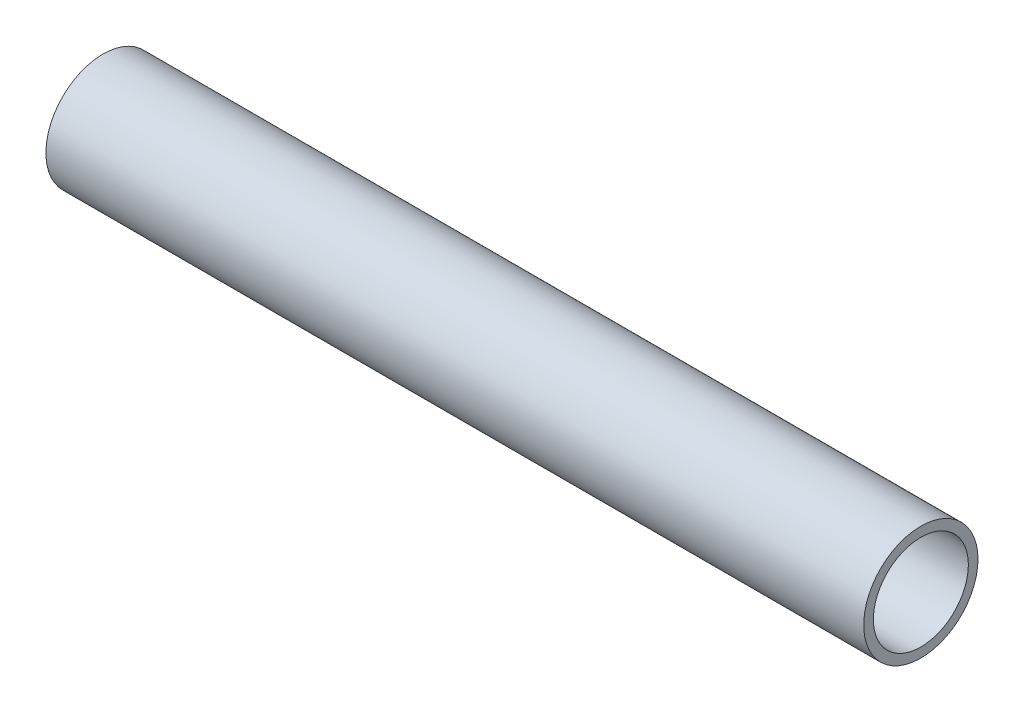
ISO-10303-21;
HEADER;
FILE_DESCRIPTION(('STEP AP214'),'2;1');
FILE_NAME('part.step','',(''),(''),'','','');
FILE_SCHEMA(('AUTOMOTIVE_DESIGN { 1 0 10303 214 1 1 1 1 }'));
ENDSEC;
DATA;
#1=APPLICATION_CONTEXT('core data for automotive mechanical design processes');
#2=APPLICATION_PROTOCOL_DEFINITION('international standard','automotive_design',2000,#1);
#3=PRODUCT_CONTEXT('',#1,'mechanical');
#4=PRODUCT('Part','Part','',(#3));
#5=PRODUCT_RELATED_PRODUCT_CATEGORY('part','',(#4));
#6=PRODUCT_DEFINITION_FORMATION('','',#4);
#7=PRODUCT_DEFINITION_CONTEXT('part definition',#1,'design');
#8=PRODUCT_DEFINITION('design','',#6,#7);
#9=PRODUCT_DEFINITION_SHAPE('','',#8);
#10=(LENGTH_UNIT() NAMED_UNIT(*) SI_UNIT(.MILLI.,.METRE.));
#11=(NAMED_UNIT(*) PLANE_ANGLE_UNIT() SI_UNIT($,.RADIAN.));
#12=(NAMED_UNIT(*) SI_UNIT($,.STERADIAN.) SOLID_ANGLE_UNIT());
#13=UNCERTAINTY_MEASURE_WITH_UNIT(LENGTH_MEASURE(1.E-05),#10,'distance_accuracy_value','');
#14=(GEOMETRIC_REPRESENTATION_CONTEXT(3) GLOBAL_UNCERTAINTY_ASSIGNED_CONTEXT((#13)) GLOBAL_UNIT_ASSIGNED_CONTEXT((#10,
#11,#12)) REPRESENTATION_CONTEXT('',''));
#15=CARTESIAN_POINT('',(0.,0.,0.));
#16=DIRECTION('',(0.,0.,1.));
#17=DIRECTION('',(1.,0.,0.));
#18=AXIS2_PLACEMENT_3D('',#15,#16,#17);
#19=CARTESIAN_POINT('',(-174.625,0.,0.));
#20=DIRECTION('',(1.,0.,0.));
#21=DIRECTION('',(0.,0.,-1.));
#22=AXIS2_PLACEMENT_3D('',#19,#20,#21);
#23=CYLINDRICAL_SURFACE('',#22,21.082);
#24=CARTESIAN_POINT('',(-95.25,0.,-21.082));
#25=CARTESIAN_POINT('',(-95.2500073037573,-0.177265588906064,-21.0819971511082));
#26=CARTESIAN_POINT('',(-95.2648956722781,-0.354633825443564,-21.0797407978607));
#27=CARTESIAN_POINT('',(-95.3240403602155,-0.704412011201185,-21.0709569196678));
#28=CARTESIAN_POINT('',(-95.3683252199961,-0.876816971803983,-21.064425243998));
#29=CARTESIAN_POINT('',(-95.4849091388346,-1.21155604974819,-21.0478246855302));
#30=CARTESIAN_POINT('',(-95.5571869641717,-1.37389769247853,-21.0377584843423));
#31=CARTESIAN_POINT('',(-95.7276530975323,-1.68412370373539,-21.0152009969064));
#32=CARTESIAN_POINT('',(-95.8258378289602,-1.83201006403648,-21.0027100454717));
#33=CARTESIAN_POINT('',(-96.0461542058056,-2.1103164343508,-20.9765819826565));
#34=CARTESIAN_POINT('',(-96.1684495601003,-2.24060616148058,-20.9629374218632));
#35=CARTESIAN_POINT('',(-96.4331633864275,-2.47889671955908,-20.9360982303561));
#36=CARTESIAN_POINT('',(-96.5755830188655,-2.58689626432783,-20.9229036256421));
#37=CARTESIAN_POINT('',(-96.8773786544134,-2.77804840978028,-20.8983859912104));
#38=CARTESIAN_POINT('',(-97.0368354067939,-2.86107486347092,-20.8870725883659));
#39=CARTESIAN_POINT('',(-97.3676295731584,-2.99911783525677,-20.8677000439257));
#40=CARTESIAN_POINT('',(-97.5389663337644,-3.05413589237424,-20.8596407235276));
#41=CARTESIAN_POINT('',(-97.8872863628436,-3.13419550245968,-20.8477621012251));
#42=CARTESIAN_POINT('',(-98.0642172558634,-3.15946016290709,-20.8439112577396));
#43=CARTESIAN_POINT('',(-98.419845943067,-3.17998699422211,-20.8407898425614));
#44=CARTESIAN_POINT('',(-98.5985436343971,-3.17525090142445,-20.8415190057945));
#45=CARTESIAN_POINT('',(-98.9510567099515,-3.13609297404926,-20.8474463775802));
#46=CARTESIAN_POINT('',(-99.1249004248299,-3.101919701057,-20.852607165254));
#47=CARTESIAN_POINT('',(-99.4643579756068,-3.00524659900985,-20.8667578327125));
#48=CARTESIAN_POINT('',(-99.6299715768266,-2.94274596272441,-20.8757478216156));
#49=CARTESIAN_POINT('',(-99.9490235812398,-2.7909340011809,-20.8965852461813));
#50=CARTESIAN_POINT('',(-100.102411162019,-2.70151746318004,-20.9084438587404));
#51=CARTESIAN_POINT('',(-100.392099144084,-2.498486828096,-20.9336742925736));
#52=CARTESIAN_POINT('',(-100.528398414064,-2.38487113028628,-20.9470462139227));
#53=CARTESIAN_POINT('',(-100.781481243325,-2.1353032656861,-20.9739618878806));
#54=CARTESIAN_POINT('',(-100.898054144489,-1.9991374095518,-20.9875060134767));
#55=CARTESIAN_POINT('',(-101.106725455512,-1.70906259522473,-21.0131148002247));
#56=CARTESIAN_POINT('',(-101.198823756631,-1.55515355820368,-21.0251794548033));
#57=CARTESIAN_POINT('',(-101.355942659601,-1.23377816277264,-21.0464826923882));
#58=CARTESIAN_POINT('',(-101.420946926471,-1.06630369822491,-21.0557195696406));
#59=CARTESIAN_POINT('',(-101.521848958346,-0.722645240857131,-21.070312259879));
#60=CARTESIAN_POINT('',(-101.557748707077,-0.546461842495156,-21.0756683373726));
#61=CARTESIAN_POINT('',(-101.599142333219,-0.192204765370484,-21.0818608911754));
#62=CARTESIAN_POINT('',(-101.604925808796,-0.0141656498471117,-21.0827404122035));
#63=CARTESIAN_POINT('',(-101.586691518388,0.340339952440575,-21.0799979514801));
#64=CARTESIAN_POINT('',(-101.562674682621,0.516806488119838,-21.0763761102388));
#65=CARTESIAN_POINT('',(-101.485762333879,0.862279899383912,-21.0650645063623));
#66=CARTESIAN_POINT('',(-101.433007989693,1.03131891039134,-21.0573946347692));
#67=CARTESIAN_POINT('',(-101.300267051749,1.35815274399449,-21.0388441665934));
#68=CARTESIAN_POINT('',(-101.220279170212,1.51594703443953,-21.0279634181826));
#69=CARTESIAN_POINT('',(-101.034662860785,1.8170851157619,-21.0040933283749));
#70=CARTESIAN_POINT('',(-100.928850826916,1.9603145348408,-20.9910891189132));
#71=CARTESIAN_POINT('',(-100.694845351182,2.22708618632573,-20.9644655933992));
#72=CARTESIAN_POINT('',(-100.566650597521,2.35062726403486,-20.9508462413297));
#73=CARTESIAN_POINT('',(-100.290229093112,2.57556977848285,-20.9243908347895));
#74=CARTESIAN_POINT('',(-100.141843493739,2.67677703259561,-20.9115622997957));
#75=CARTESIAN_POINT('',(-99.8300080053974,2.85282903090451,-20.888274456038));
#76=CARTESIAN_POINT('',(-99.6665585261644,2.92767449187153,-20.8778150828597));
#77=CARTESIAN_POINT('',(-99.3298127983176,3.04857772519442,-20.8605043047131));
#78=CARTESIAN_POINT('',(-99.156553855138,3.09473749350593,-20.8536401303661));
#79=CARTESIAN_POINT('',(-98.8046316089195,3.15728352894343,-20.8442630448294));
#80=CARTESIAN_POINT('',(-98.6259686832474,3.17367187018762,-20.8417498305174));
#81=CARTESIAN_POINT('',(-98.2702456638402,3.17616021106898,-20.8413705974415));
#82=CARTESIAN_POINT('',(-98.0931876803551,3.16256554437416,-20.8434577306442));
#83=CARTESIAN_POINT('',(-97.7439067922048,3.10612829026899,-20.8519421795031));
#84=CARTESIAN_POINT('',(-97.5716838795403,3.0632857512491,-20.8583394880282));
#85=CARTESIAN_POINT('',(-97.2370476835853,2.94967717748468,-20.874707044174));
#86=CARTESIAN_POINT('',(-97.0746269537971,2.87893265513937,-20.8846745386426));
#87=CARTESIAN_POINT('',(-96.7639105714977,2.71155871536682,-20.9070627102117));
#88=CARTESIAN_POINT('',(-96.6156154052644,2.61492840724794,-20.9194834717215));
#89=CARTESIAN_POINT('',(-96.3358087193127,2.39741725845485,-20.9455292166376));
#90=CARTESIAN_POINT('',(-96.2044739082908,2.27631033164997,-20.9591647100844));
#91=CARTESIAN_POINT('',(-95.9638828183518,2.01376149306829,-20.9860159394496));
#92=CARTESIAN_POINT('',(-95.8546316769312,1.87231486257537,-20.9992315770924));
#93=CARTESIAN_POINT('',(-95.6607669697578,1.57217776718591,-21.0238378848768));
#94=CARTESIAN_POINT('',(-95.5762935254673,1.41339594518084,-21.0352180180234));
#95=CARTESIAN_POINT('',(-95.4353412780308,1.08380087043067,-21.0547677779054));
#96=CARTESIAN_POINT('',(-95.3788335193363,0.913000272113382,-21.0629407235248));
#97=CARTESIAN_POINT('',(-95.3082168635909,0.61786433248082,-21.0732924950954));
#98=CARTESIAN_POINT('',(-95.2864189599853,0.495349503289427,-21.0765410154751));
#99=CARTESIAN_POINT('',(-95.2573080583054,0.248573261637359,-21.0808957533839));
#100=CARTESIAN_POINT('',(-95.2499948780599,0.124311871162614,-21.0820019978558));
#101=CARTESIAN_POINT('',(-95.25,0.,-21.082));
#102=B_SPLINE_CURVE_WITH_KNOTS('',3,(#24,#25,#26,#27,#28,#29,#30,#31,#32,#33,#34,#35,#36,#37,
#38,#39,#40,#41,#42,#43,#44,#45,#46,#47,#48,#49,#50,#51,#52,#53,#54,#55,#56,#57,#58,#59,#60,#61,
#62,#63,#64,#65,#66,#67,#68,#69,#70,#71,#72,#73,#74,#75,#76,#77,#78,#79,#80,#81,#82,#83,#84,#85,
#86,#87,#88,#89,#90,#91,#92,#93,#94,#95,#96,#97,#98,#99,#100,#101),.UNSPECIFIED.,.T.,.F.,(4,2,2,
2,2,2,2,2,2,2,2,2,2,2,2,2,2,2,2,2,2,2,2,2,2,2,2,2,2,2,2,2,2,2,2,2,2,2,4),(0.,0.531342512429038,
1.06320164882558,1.5946581376531,2.12604129424767,2.66116512439551,3.19631982343617,
3.73413403476704,4.27191869076775,4.80564452954641,5.33933947849273,5.86857170164552,
6.39781900700991,6.92916258470441,7.46054132064733,7.99727852314497,8.53401811031673,
9.07108083107699,9.6081069432693,10.1399593459211,10.6717951472021,11.2010416383702,
11.730313159249,12.2634633412738,12.7966447804,13.3342937698578,13.8719281396386,
14.4076397711918,14.9433140793118,15.4735585288678,16.0038021011393,16.5336376528597,
17.0634914377811,17.5984835709691,18.1336000206727,18.6716867332597,19.2092151415009,
19.5818368843675,19.9544539408189),.UNSPECIFIED.);
#103=CARTESIAN_POINT('',(-95.25,0.,-21.082));
#104=VERTEX_POINT('',#103);
#105=EDGE_CURVE('E77',#104,#104,#102,.T.);
#106=ORIENTED_EDGE('',*,*,#105,.F.);
#107=EDGE_LOOP('',(#106));
#108=FACE_BOUND('',#107,.T.);
#109=CARTESIAN_POINT('',(-146.05,0.,-21.082));
#110=CARTESIAN_POINT('',(-146.050007303757,-0.177265588906064,-21.0819971511082));
#111=CARTESIAN_POINT('',(-146.064895672278,-0.354633825443566,-21.0797407978607));
#112=CARTESIAN_POINT('',(-146.124040360215,-0.704412011201187,-21.0709569196678));
#113=CARTESIAN_POINT('',(-146.168325219996,-0.876816971803985,-21.064425243998));
#114=CARTESIAN_POINT('',(-146.284909138835,-1.21155604974819,-21.0478246855302));
#115=CARTESIAN_POINT('',(-146.357186964172,-1.37389769247854,-21.0377584843423));
#116=CARTESIAN_POINT('',(-146.527653097532,-1.6841237037354,-21.0152009969064));
#117=CARTESIAN_POINT('',(-146.62583782896,-1.8320100640365,-21.0027100454717));
#118=CARTESIAN_POINT('',(-146.846154205806,-2.11031643435081,-20.9765819826565));
#119=CARTESIAN_POINT('',(-146.9684495601,-2.24060616148059,-20.9629374218632));
#120=CARTESIAN_POINT('',(-147.233163386427,-2.47889671955909,-20.9360982303561));
#121=CARTESIAN_POINT('',(-147.375583018865,-2.58689626432784,-20.9229036256421));
#122=CARTESIAN_POINT('',(-147.677378654413,-2.77804840978029,-20.8983859912104));
#123=CARTESIAN_POINT('',(-147.836835406794,-2.86107486347093,-20.8870725883659));
#124=CARTESIAN_POINT('',(-148.167629573158,-2.99911783525678,-20.8677000439257));
#125=CARTESIAN_POINT('',(-148.338966333764,-3.05413589237425,-20.8596407235276));
#126=CARTESIAN_POINT('',(-148.687286362844,-3.13419550245969,-20.8477621012251));
#127=CARTESIAN_POINT('',(-148.864217255863,-3.15946016290709,-20.8439112577396));
#128=CARTESIAN_POINT('',(-149.219845943067,-3.17998699422211,-20.8407898425614));
#129=CARTESIAN_POINT('',(-149.398543634397,-3.17525090142445,-20.8415190057945));
#130=CARTESIAN_POINT('',(-149.751056709951,-3.13609297404926,-20.8474463775802));
#131=CARTESIAN_POINT('',(-149.92490042483,-3.101919701057,-20.852607165254));
#132=CARTESIAN_POINT('',(-150.264357975607,-3.00524659900985,-20.8667578327125));
#133=CARTESIAN_POINT('',(-150.429971576827,-2.9427459627244,-20.8757478216156));
#134=CARTESIAN_POINT('',(-150.74902358124,-2.79093400118089,-20.8965852461813));
#135=CARTESIAN_POINT('',(-150.902411162019,-2.70151746318001,-20.9084438587404));
#136=CARTESIAN_POINT('',(-151.192099144084,-2.49848682809597,-20.9336742925736));
#137=CARTESIAN_POINT('',(-151.328398414064,-2.38487113028625,-20.9470462139227));
#138=CARTESIAN_POINT('',(-151.581481243325,-2.13530326568607,-20.9739618878807));
#139=CARTESIAN_POINT('',(-151.698054144489,-1.99913740955177,-20.9875060134767));
#140=CARTESIAN_POINT('',(-151.906725455512,-1.70906259522471,-21.0131148002247));
#141=CARTESIAN_POINT('',(-151.998823756631,-1.55515355820366,-21.0251794548033));
#142=CARTESIAN_POINT('',(-152.155942659601,-1.23377816277263,-21.0464826923882));
#143=CARTESIAN_POINT('',(-152.220946926471,-1.0663036982249,-21.0557195696406));
#144=CARTESIAN_POINT('',(-152.321848958346,-0.722645240857127,-21.070312259879));
#145=CARTESIAN_POINT('',(-152.357748707077,-0.546461842495151,-21.0756683373726));
#146=CARTESIAN_POINT('',(-152.399142333219,-0.192204765370476,-21.0818608911754));
#147=CARTESIAN_POINT('',(-152.404925808796,-0.014165649847103,-21.0827404122035));
#148=CARTESIAN_POINT('',(-152.386691518388,0.340339952440583,-21.0799979514801));
#149=CARTESIAN_POINT('',(-152.362674682621,0.516806488119846,-21.0763761102388));
#150=CARTESIAN_POINT('',(-152.285762333879,0.86227989938392,-21.0650645063623));
#151=CARTESIAN_POINT('',(-152.233007989693,1.03131891039135,-21.0573946347692));
#152=CARTESIAN_POINT('',(-152.100267051749,1.3581527439945,-21.0388441665934));
#153=CARTESIAN_POINT('',(-152.020279170212,1.51594703443955,-21.0279634181826));
#154=CARTESIAN_POINT('',(-151.834662860785,1.8170851157619,-21.0040933283749));
#155=CARTESIAN_POINT('',(-151.728850826916,1.96031453484078,-20.9910891189132));
#156=CARTESIAN_POINT('',(-151.494845351182,2.22708618632572,-20.9644655933992));
#157=CARTESIAN_POINT('',(-151.366650597521,2.35062726403487,-20.9508462413297));
#158=CARTESIAN_POINT('',(-151.090229093112,2.57556977848286,-20.9243908347895));
#159=CARTESIAN_POINT('',(-150.941843493739,2.67677703259561,-20.9115622997957));
#160=CARTESIAN_POINT('',(-150.630008005397,2.8528290309045,-20.888274456038));
#161=CARTESIAN_POINT('',(-150.466558526164,2.92767449187153,-20.8778150828597));
#162=CARTESIAN_POINT('',(-150.129812798318,3.04857772519442,-20.8605043047131));
#163=CARTESIAN_POINT('',(-149.956553855138,3.09473749350594,-20.8536401303661));
#164=CARTESIAN_POINT('',(-149.604631608919,3.15728352894343,-20.8442630448294));
#165=CARTESIAN_POINT('',(-149.425968683247,3.17367187018762,-20.8417498305174));
#166=CARTESIAN_POINT('',(-149.07024566384,3.17616021106899,-20.8413705974415));
#167=CARTESIAN_POINT('',(-148.893187680355,3.16256554437416,-20.8434577306442));
#168=CARTESIAN_POINT('',(-148.543906792205,3.10612829026899,-20.8519421795031));
#169=CARTESIAN_POINT('',(-148.37168387954,3.0632857512491,-20.8583394880282));
#170=CARTESIAN_POINT('',(-148.037047683585,2.94967717748468,-20.874707044174));
#171=CARTESIAN_POINT('',(-147.874626953797,2.87893265513936,-20.8846745386426));
#172=CARTESIAN_POINT('',(-147.563910571498,2.71155871536682,-20.9070627102117));
#173=CARTESIAN_POINT('',(-147.415615405264,2.61492840724794,-20.9194834717215));
#174=CARTESIAN_POINT('',(-147.135808719313,2.39741725845485,-20.9455292166376));
#175=CARTESIAN_POINT('',(-147.004473908291,2.27631033164997,-20.9591647100844));
#176=CARTESIAN_POINT('',(-146.763882818352,2.01376149306828,-20.9860159394496));
#177=CARTESIAN_POINT('',(-146.654631676931,1.87231486257536,-20.9992315770924));
#178=CARTESIAN_POINT('',(-146.460766969758,1.57217776718591,-21.0238378848768));
#179=CARTESIAN_POINT('',(-146.376293525467,1.41339594518084,-21.0352180180234));
#180=CARTESIAN_POINT('',(-146.235341278031,1.08380087043067,-21.0547677779054));
#181=CARTESIAN_POINT('',(-146.178833519336,0.913000272113373,-21.0629407235248));
#182=CARTESIAN_POINT('',(-146.108216863591,0.617864332480807,-21.0732924950954));
#183=CARTESIAN_POINT('',(-146.086418959985,0.495349503289417,-21.0765410154751));
#184=CARTESIAN_POINT('',(-146.057308058305,0.248573261637354,-21.0808957533839));
#185=CARTESIAN_POINT('',(-146.04999487806,0.124311871162612,-21.0820019978558));
#186=CARTESIAN_POINT('',(-146.05,0.,-21.082));
#187=B_SPLINE_CURVE_WITH_KNOTS('',3,(#109,#110,#111,#112,#113,#114,#115,#116,#117,#118,#119,
#120,#121,#122,#123,#124,#125,#126,#127,#128,#129,#130,#131,#132,#133,#134,#135,#136,#137,#138,
#139,#140,#141,#142,#143,#144,#145,#146,#147,#148,#149,#150,#151,#152,#153,#154,#155,#156,#157,
#158,#159,#160,#161,#162,#163,#164,#165,#166,#167,#168,#169,#170,#171,#172,#173,#174,#175,#176,
#177,#178,#179,#180,#181,#182,#183,#184,#185,#186),.UNSPECIFIED.,.T.,.F.,(4,2,2,2,2,2,2,2,2,2,2,
2,2,2,2,2,2,2,2,2,2,2,2,2,2,2,2,2,2,2,2,2,2,2,2,2,2,2,4),(0.,0.53134251242904,1.06320164882559,
1.59465813765311,2.12604129424768,2.66116512439553,3.19631982343618,3.73413403476707,
4.27191869076778,4.80564452954643,5.33933947849274,5.86857170164554,6.39781900700992,
6.92916258470446,7.46054132064736,7.99727852314501,8.53401811031675,9.071080831077,
9.60810694326931,10.1399593459211,10.6717951472021,11.2010416383702,11.730313159249,
12.2634633412738,12.7966447804,13.3342937698578,13.8719281396386,14.4076397711918,
14.9433140793118,15.4735585288678,16.0038021011393,16.5336376528597,17.0634914377811,
17.5984835709691,18.1336000206728,18.6716867332597,19.2092151415009,19.5818368843675,
19.9544539408189),.UNSPECIFIED.);
#188=CARTESIAN_POINT('',(-146.05,0.,-21.082));
#189=VERTEX_POINT('',#188);
#190=EDGE_CURVE('E59',#189,#189,#187,.T.);
#191=ORIENTED_EDGE('',*,*,#190,.F.);
#192=EDGE_LOOP('',(#191));
#193=FACE_BOUND('',#192,.T.);
#194=CARTESIAN_POINT('',(-174.625,0.,0.));
#195=DIRECTION('',(1.,0.,0.));
#196=DIRECTION('',(0.,0.,-1.));
#197=AXIS2_PLACEMENT_3D('',#194,#195,#196);
#198=CIRCLE('',#197,21.082);
#199=CARTESIAN_POINT('',(-174.625,0.,-21.082));
#200=VERTEX_POINT('',#199);
#201=EDGE_CURVE('E10',#200,#200,#198,.T.);
#202=ORIENTED_EDGE('',*,*,#201,.T.);
#203=EDGE_LOOP('',(#202));
#204=FACE_BOUND('',#203,.T.);
#205=CARTESIAN_POINT('',(127.,0.,0.));
#206=DIRECTION('',(1.,0.,0.));
#207=DIRECTION('',(0.,0.,-1.));
#208=AXIS2_PLACEMENT_3D('',#205,#206,#207);
#209=CIRCLE('',#208,21.082);
#210=CARTESIAN_POINT('',(127.,0.,-21.082));
#211=VERTEX_POINT('',#210);
#212=EDGE_CURVE('E50',#211,#211,#209,.T.);
#213=ORIENTED_EDGE('',*,*,#212,.F.);
#214=EDGE_LOOP('',(#213));
#215=FACE_BOUND('',#214,.T.);
#216=ADVANCED_FACE('F32',(#108,#193,#204,#215),#23,.T.);
#217=CARTESIAN_POINT('',(-174.625,0.,0.));
#218=DIRECTION('',(1.,0.,0.));
#219=DIRECTION('',(0.,0.,-1.));
#220=AXIS2_PLACEMENT_3D('',#217,#218,#219);
#221=PLANE('',#220);
#222=CARTESIAN_POINT('',(-174.625,0.,0.));
#223=DIRECTION('',(1.,0.,0.));
#224=DIRECTION('',(0.,0.,-1.));
#225=AXIS2_PLACEMENT_3D('',#222,#223,#224);
#226=CIRCLE('',#225,17.526);
#227=CARTESIAN_POINT('',(-174.625,0.,-17.526));
#228=VERTEX_POINT('',#227);
#229=EDGE_CURVE('E45',#228,#228,#226,.T.);
#230=ORIENTED_EDGE('',*,*,#229,.T.);
#231=EDGE_LOOP('',(#230));
#232=FACE_BOUND('',#231,.T.);
#233=ORIENTED_EDGE('',*,*,#201,.F.);
#234=EDGE_LOOP('',(#233));
#235=FACE_BOUND('',#234,.T.);
#236=ADVANCED_FACE('F91',(#232,#235),#221,.F.);
#237=CARTESIAN_POINT('',(-174.625,0.,0.));
#238=DIRECTION('',(1.,0.,0.));
#239=DIRECTION('',(0.,0.,-1.));
#240=AXIS2_PLACEMENT_3D('',#237,#238,#239);
#241=CYLINDRICAL_SURFACE('',#240,17.526);
#242=CARTESIAN_POINT('',(-101.6,0.,-17.526));
#243=CARTESIAN_POINT('',(-101.599993132515,0.17679082350801,-17.5259968412274));
#244=CARTESIAN_POINT('',(-101.585183965731,0.353672270747988,-17.5232972774411));
#245=CARTESIAN_POINT('',(-101.526372438004,0.702458155041369,-17.5127883009458));
#246=CARTESIAN_POINT('',(-101.482344740396,0.874358137310072,-17.5049744534986));
#247=CARTESIAN_POINT('',(-101.366482418544,1.20808580036967,-17.485111731742));
#248=CARTESIAN_POINT('',(-101.29467216344,1.36992216434489,-17.4730665697294));
#249=CARTESIAN_POINT('',(-101.125350679922,1.67923272236702,-17.4460593997375));
#250=CARTESIAN_POINT('',(-101.027841801324,1.82670822784651,-17.4310976584752));
#251=CARTESIAN_POINT('',(-100.808729501993,2.10478127681952,-17.3997234174553));
#252=CARTESIAN_POINT('',(-100.686893953305,2.23519445696564,-17.3832978577657));
#253=CARTESIAN_POINT('',(-100.423086238519,2.47384671567764,-17.3509451203049));
#254=CARTESIAN_POINT('',(-100.281112684689,2.58208426483874,-17.3350179769725));
#255=CARTESIAN_POINT('',(-99.97976755925,2.77407084888639,-17.3053386524232));
#256=CARTESIAN_POINT('',(-99.82027574471,2.8576339824516,-17.2916033234658));
#257=CARTESIAN_POINT('',(-99.4892275026837,2.99671002667021,-17.2680459841376));
#258=CARTESIAN_POINT('',(-99.3176720447767,3.05222518866685,-17.2582236596927));
#259=CARTESIAN_POINT('',(-98.9693334205962,3.13304110203761,-17.2437354838221));
#260=CARTESIAN_POINT('',(-98.7926269370351,3.15866238598856,-17.2390149702052));
#261=CARTESIAN_POINT('',(-98.4373650062532,3.17995782064228,-17.235099927382));
#262=CARTESIAN_POINT('',(-98.2588097149559,3.1756344765814,-17.2359049358977));
#263=CARTESIAN_POINT('',(-97.9072300510038,3.13742365897766,-17.2429001682717));
#264=CARTESIAN_POINT('',(-97.7341647086679,3.10389926153133,-17.2490242538492));
#265=CARTESIAN_POINT('',(-97.3961562140921,3.00880912932249,-17.2658638407267));
#266=CARTESIAN_POINT('',(-97.231213386391,2.94724227511612,-17.2765795253205));
#267=CARTESIAN_POINT('',(-96.9130619363625,2.79745571266688,-17.3014647929721));
#268=CARTESIAN_POINT('',(-96.7599245079335,2.7090880872545,-17.3156534578234));
#269=CARTESIAN_POINT('',(-96.470514150003,2.50831315208051,-17.3458731721502));
#270=CARTESIAN_POINT('',(-96.3342428236547,2.39590355985285,-17.3619043964854));
#271=CARTESIAN_POINT('',(-96.0803338962992,2.14827149301383,-17.3942918762038));
#272=CARTESIAN_POINT('',(-95.962999429291,2.01273815664841,-17.4106494468318));
#273=CARTESIAN_POINT('',(-95.7526886211131,1.72374960651158,-17.4416297211863));
#274=CARTESIAN_POINT('',(-95.6597124943575,1.57029423499867,-17.4562524096409));
#275=CARTESIAN_POINT('',(-95.500718396598,1.24951132270804,-17.4821419521182));
#276=CARTESIAN_POINT('',(-95.4347304486683,1.08216858038397,-17.4934050650234));
#277=CARTESIAN_POINT('',(-95.3318843483637,0.738524824278316,-17.5112771866033));
#278=CARTESIAN_POINT('',(-95.2950233103667,0.562224699752744,-17.5178866563105));
#279=CARTESIAN_POINT('',(-95.2518958271967,0.208280155645573,-17.5256438790602));
#280=CARTESIAN_POINT('',(-95.245213792981,0.0306879466818638,-17.5268658171028));
#281=CARTESIAN_POINT('',(-95.2615213711922,-0.323076767936696,-17.5239146703191));
#282=CARTESIAN_POINT('',(-95.2845096264779,-0.499249338156001,-17.5197418322538));
#283=CARTESIAN_POINT('',(-95.3591596423848,-0.843866600411555,-17.5065161011469));
#284=CARTESIAN_POINT('',(-95.4106125479722,-1.01235801735561,-17.4974987676082));
#285=CARTESIAN_POINT('',(-95.5405063595171,-1.33832313012139,-17.4755909179164));
#286=CARTESIAN_POINT('',(-95.6189490011885,-1.49579611656221,-17.4627001526692));
#287=CARTESIAN_POINT('',(-95.8015255027009,-1.7970379428255,-17.4342904171948));
#288=CARTESIAN_POINT('',(-95.9059150975122,-1.94064931955918,-17.4187457992515));
#289=CARTESIAN_POINT('',(-96.1370744185283,-2.20846506883692,-17.3868220571775));
#290=CARTESIAN_POINT('',(-96.2638460863583,-2.33266775593063,-17.3704428607355));
#291=CARTESIAN_POINT('',(-96.5380470534088,-2.55970748627499,-17.3384518393717));
#292=CARTESIAN_POINT('',(-96.6857120955064,-2.66226178053651,-17.3228519867864));
#293=CARTESIAN_POINT('',(-96.9964178334415,-2.84110984177048,-17.2944212278246));
#294=CARTESIAN_POINT('',(-97.1594579820262,-2.91740454296296,-17.2815902229488));
#295=CARTESIAN_POINT('',(-97.4955450343434,-3.04115979533501,-17.2602426012819));
#296=CARTESIAN_POINT('',(-97.6685416025097,-3.08875345587471,-17.2517060985603));
#297=CARTESIAN_POINT('',(-98.0202437321866,-3.15416897697809,-17.2398671271274));
#298=CARTESIAN_POINT('',(-98.1989486950753,-3.17199394891527,-17.2365641114227));
#299=CARTESIAN_POINT('',(-98.5541655418571,-3.17726742876193,-17.2355925385196));
#300=CARTESIAN_POINT('',(-98.7306707384355,-3.16516161695717,-17.2378413124165));
#301=CARTESIAN_POINT('',(-99.0790866320758,-3.11188910689162,-17.2475373034534));
#302=CARTESIAN_POINT('',(-99.2509973523558,-3.07072255551699,-17.2549844943182));
#303=CARTESIAN_POINT('',(-99.5851258972035,-2.96067981082377,-17.2742044563146));
#304=CARTESIAN_POINT('',(-99.7473590229442,-2.89184876708741,-17.2859701767276));
#305=CARTESIAN_POINT('',(-100.058046204287,-2.72847862049299,-17.3125070165183));
#306=CARTESIAN_POINT('',(-100.20649937582,-2.633937869728,-17.3272783285292));
#307=CARTESIAN_POINT('',(-100.487651300551,-2.42026944589855,-17.3584203635157));
#308=CARTESIAN_POINT('',(-100.620100559389,-2.30081626698696,-17.37481057328));
#309=CARTESIAN_POINT('',(-100.86322420719,-2.04139533634304,-17.4071948659678));
#310=CARTESIAN_POINT('',(-100.973893583025,-1.90142287454245,-17.4231888569539));
#311=CARTESIAN_POINT('',(-101.171171023297,-1.60354404533997,-17.4531342301883));
#312=CARTESIAN_POINT('',(-101.257571193469,-1.44549813095465,-17.4670675069251));
#313=CARTESIAN_POINT('',(-101.402456942508,-1.11693687333548,-17.4911451342375));
#314=CARTESIAN_POINT('',(-101.460969245347,-0.946433648982045,-17.5012931100993));
#315=CARTESIAN_POINT('',(-101.536276479759,-0.646146664812306,-17.5145413811557));
#316=CARTESIAN_POINT('',(-101.560132786512,-0.518138865968811,-17.5188145120769));
#317=CARTESIAN_POINT('',(-101.591996893811,-0.26010370060993,-17.5245449517082));
#318=CARTESIAN_POINT('',(-101.600005052851,-0.130076379844328,-17.5260023241122));
#319=CARTESIAN_POINT('',(-101.6,0.,-17.526));
#320=B_SPLINE_CURVE_WITH_KNOTS('',3,(#242,#243,#244,#245,#246,#247,#248,#249,#250,#251,#252,
#253,#254,#255,#256,#257,#258,#259,#260,#261,#262,#263,#264,#265,#266,#267,#268,#269,#270,#271,
#272,#273,#274,#275,#276,#277,#278,#279,#280,#281,#282,#283,#284,#285,#286,#287,#288,#289,#290,
#291,#292,#293,#294,#295,#296,#297,#298,#299,#300,#301,#302,#303,#304,#305,#306,#307,#308,#309,
#310,#311,#312,#313,#314,#315,#316,#317,#318,#319),.UNSPECIFIED.,.T.,.F.,(4,2,2,2,2,2,2,2,2,2,2,
2,2,2,2,2,2,2,2,2,2,2,2,2,2,2,2,2,2,2,2,2,2,2,2,2,2,2,4),(0.,0.52989684739867,1.06025379298761,
1.59014659312776,2.11999095802632,2.65515610450925,3.19035814774705,3.7294952286848,
4.26858902750702,4.80184775131232,5.33506186200683,5.86173930617047,6.38843777693352,
6.91809776769747,7.4478080649945,7.985299753981,8.52279617407827,9.06088891772033,
9.59892834547637,10.1295354893394,10.6601183636945,11.1868588327276,11.713633182854,
12.2458209999474,12.778055006572,13.3168607871052,13.8556473969222,14.3919156166157,
14.9281277829441,15.4564037756751,15.9846770982784,16.5120917356115,17.0395401864443,
17.5743685624972,18.1093198977251,18.6487229234539,19.1876080135939,19.5774960261897,
19.9673752191978),.UNSPECIFIED.);
#321=CARTESIAN_POINT('',(-101.6,0.,-17.526));
#322=VERTEX_POINT('',#321);
#323=EDGE_CURVE('E36',#322,#322,#320,.T.);
#324=ORIENTED_EDGE('',*,*,#323,.T.);
#325=EDGE_LOOP('',(#324));
#326=FACE_BOUND('',#325,.T.);
#327=CARTESIAN_POINT('',(-152.4,0.,-17.526));
#328=CARTESIAN_POINT('',(-152.399993132515,0.176790823508009,-17.5259968412274));
#329=CARTESIAN_POINT('',(-152.385183965731,0.353672270747985,-17.5232972774411));
#330=CARTESIAN_POINT('',(-152.326372438004,0.702458155041367,-17.5127883009458));
#331=CARTESIAN_POINT('',(-152.282344740396,0.874358137310074,-17.5049744534986));
#332=CARTESIAN_POINT('',(-152.166482418544,1.20808580036968,-17.485111731742));
#333=CARTESIAN_POINT('',(-152.09467216344,1.3699221643449,-17.4730665697294));
#334=CARTESIAN_POINT('',(-151.925350679922,1.67923272236704,-17.4460593997375));
#335=CARTESIAN_POINT('',(-151.827841801324,1.82670822784652,-17.4310976584752));
#336=CARTESIAN_POINT('',(-151.608729501993,2.10478127681953,-17.3997234174553));
#337=CARTESIAN_POINT('',(-151.486893953305,2.23519445696565,-17.3832978577657));
#338=CARTESIAN_POINT('',(-151.223086238519,2.47384671567765,-17.3509451203049));
#339=CARTESIAN_POINT('',(-151.081112684689,2.58208426483874,-17.3350179769725));
#340=CARTESIAN_POINT('',(-150.77976755925,2.77407084888639,-17.3053386524232));
#341=CARTESIAN_POINT('',(-150.62027574471,2.8576339824516,-17.2916033234658));
#342=CARTESIAN_POINT('',(-150.289227502684,2.99671002667021,-17.2680459841376));
#343=CARTESIAN_POINT('',(-150.117672044777,3.05222518866685,-17.2582236596927));
#344=CARTESIAN_POINT('',(-149.769333420596,3.13304110203761,-17.2437354838221));
#345=CARTESIAN_POINT('',(-149.592626937035,3.15866238598857,-17.2390149702052));
#346=CARTESIAN_POINT('',(-149.237365006253,3.17995782064228,-17.235099927382));
#347=CARTESIAN_POINT('',(-149.058809714956,3.1756344765814,-17.2359049358977));
#348=CARTESIAN_POINT('',(-148.707230051004,3.13742365897766,-17.2429001682717));
#349=CARTESIAN_POINT('',(-148.534164708668,3.10389926153133,-17.2490242538492));
#350=CARTESIAN_POINT('',(-148.196156214092,3.00880912932248,-17.2658638407267));
#351=CARTESIAN_POINT('',(-148.031213386391,2.94724227511611,-17.2765795253205));
#352=CARTESIAN_POINT('',(-147.713061936362,2.79745571266685,-17.3014647929721));
#353=CARTESIAN_POINT('',(-147.559924507933,2.70908808725447,-17.3156534578234));
#354=CARTESIAN_POINT('',(-147.270514150003,2.50831315208049,-17.3458731721502));
#355=CARTESIAN_POINT('',(-147.134242823655,2.39590355985283,-17.3619043964854));
#356=CARTESIAN_POINT('',(-146.880333896299,2.14827149301382,-17.3942918762038));
#357=CARTESIAN_POINT('',(-146.762999429291,2.01273815664841,-17.4106494468318));
#358=CARTESIAN_POINT('',(-146.552688621113,1.72374960651158,-17.4416297211863));
#359=CARTESIAN_POINT('',(-146.459712494357,1.57029423499867,-17.4562524096409));
#360=CARTESIAN_POINT('',(-146.300718396598,1.24951132270804,-17.4821419521182));
#361=CARTESIAN_POINT('',(-146.234730448668,1.08216858038396,-17.4934050650234));
#362=CARTESIAN_POINT('',(-146.131884348364,0.738524824278307,-17.5112771866033));
#363=CARTESIAN_POINT('',(-146.095023310367,0.562224699752732,-17.5178866563105));
#364=CARTESIAN_POINT('',(-146.051895827197,0.208280155645558,-17.5256438790602));
#365=CARTESIAN_POINT('',(-146.045213792981,0.0306879466818504,-17.5268658171028));
#366=CARTESIAN_POINT('',(-146.061521371192,-0.323076767936705,-17.5239146703191));
#367=CARTESIAN_POINT('',(-146.084509626478,-0.499249338156009,-17.5197418322538));
#368=CARTESIAN_POINT('',(-146.159159642385,-0.843866600411558,-17.5065161011469));
#369=CARTESIAN_POINT('',(-146.210612547972,-1.01235801735561,-17.4974987676082));
#370=CARTESIAN_POINT('',(-146.340506359517,-1.3383231301214,-17.4755909179164));
#371=CARTESIAN_POINT('',(-146.418949001188,-1.49579611656221,-17.4627001526692));
#372=CARTESIAN_POINT('',(-146.601525502701,-1.79703794282551,-17.4342904171948));
#373=CARTESIAN_POINT('',(-146.705915097512,-1.94064931955918,-17.4187457992515));
#374=CARTESIAN_POINT('',(-146.937074418528,-2.20846506883692,-17.3868220571775));
#375=CARTESIAN_POINT('',(-147.063846086358,-2.33266775593063,-17.3704428607355));
#376=CARTESIAN_POINT('',(-147.338047053409,-2.559707486275,-17.3384518393717));
#377=CARTESIAN_POINT('',(-147.485712095506,-2.66226178053653,-17.3228519867864));
#378=CARTESIAN_POINT('',(-147.796417833441,-2.84110984177049,-17.2944212278246));
#379=CARTESIAN_POINT('',(-147.959457982026,-2.91740454296297,-17.2815902229488));
#380=CARTESIAN_POINT('',(-148.295545034343,-3.04115979533501,-17.2602426012819));
#381=CARTESIAN_POINT('',(-148.46854160251,-3.08875345587471,-17.2517060985603));
#382=CARTESIAN_POINT('',(-148.820243732187,-3.1541689769781,-17.2398671271274));
#383=CARTESIAN_POINT('',(-148.998948695075,-3.17199394891528,-17.2365641114227));
#384=CARTESIAN_POINT('',(-149.354165541857,-3.17726742876193,-17.2355925385196));
#385=CARTESIAN_POINT('',(-149.530670738435,-3.16516161695717,-17.2378413124165));
#386=CARTESIAN_POINT('',(-149.879086632076,-3.11188910689162,-17.2475373034534));
#387=CARTESIAN_POINT('',(-150.050997352356,-3.07072255551698,-17.2549844943182));
#388=CARTESIAN_POINT('',(-150.385125897204,-2.96067981082376,-17.2742044563146));
#389=CARTESIAN_POINT('',(-150.547359022944,-2.8918487670874,-17.2859701767276));
#390=CARTESIAN_POINT('',(-150.858046204287,-2.72847862049297,-17.3125070165183));
#391=CARTESIAN_POINT('',(-151.00649937582,-2.63393786972798,-17.3272783285293));
#392=CARTESIAN_POINT('',(-151.287651300551,-2.42026944589853,-17.3584203635157));
#393=CARTESIAN_POINT('',(-151.420100559389,-2.30081626698695,-17.37481057328));
#394=CARTESIAN_POINT('',(-151.66322420719,-2.04139533634303,-17.4071948659678));
#395=CARTESIAN_POINT('',(-151.773893583025,-1.90142287454244,-17.4231888569539));
#396=CARTESIAN_POINT('',(-151.971171023297,-1.60354404533996,-17.4531342301883));
#397=CARTESIAN_POINT('',(-152.057571193469,-1.44549813095464,-17.4670675069251));
#398=CARTESIAN_POINT('',(-152.202456942508,-1.11693687333546,-17.4911451342375));
#399=CARTESIAN_POINT('',(-152.260969245347,-0.946433648982028,-17.5012931100993));
#400=CARTESIAN_POINT('',(-152.336276479759,-0.646146664812287,-17.5145413811557));
#401=CARTESIAN_POINT('',(-152.360132786512,-0.518138865968793,-17.5188145120769));
#402=CARTESIAN_POINT('',(-152.391996893811,-0.260103700609919,-17.5245449517082));
#403=CARTESIAN_POINT('',(-152.400005052851,-0.130076379844322,-17.5260023241122));
#404=CARTESIAN_POINT('',(-152.4,0.,-17.526));
#405=B_SPLINE_CURVE_WITH_KNOTS('',3,(#327,#328,#329,#330,#331,#332,#333,#334,#335,#336,#337,
#338,#339,#340,#341,#342,#343,#344,#345,#346,#347,#348,#349,#350,#351,#352,#353,#354,#355,#356,
#357,#358,#359,#360,#361,#362,#363,#364,#365,#366,#367,#368,#369,#370,#371,#372,#373,#374,#375,
#376,#377,#378,#379,#380,#381,#382,#383,#384,#385,#386,#387,#388,#389,#390,#391,#392,#393,#394,
#395,#396,#397,#398,#399,#400,#401,#402,#403,#404),.UNSPECIFIED.,.T.,.F.,(4,2,2,2,2,2,2,2,2,2,2,
2,2,2,2,2,2,2,2,2,2,2,2,2,2,2,2,2,2,2,2,2,2,2,2,2,2,2,4),(0.,0.52989684739867,1.06025379298762,
1.59014659312777,2.11999095802633,2.65515610450925,3.19035814774706,3.72949522868482,
4.26858902750703,4.80184775131235,5.33506186200683,5.86173930617047,6.3884377769336,
6.91809776769754,7.44780806499452,7.985299753981,8.52279617407827,9.06088891772035,
9.59892834547639,10.1295354893394,10.6601183636946,11.1868588327276,11.713633182854,
12.2458209999474,12.778055006572,13.3168607871052,13.8556473969223,14.3919156166158,
14.9281277829441,15.4564037756751,15.9846770982785,16.5120917356116,17.0395401864443,
17.5743685624972,18.1093198977252,18.648722923454,19.1876080135939,19.5774960261897,
19.9673752191978),.UNSPECIFIED.);
#406=CARTESIAN_POINT('',(-152.4,0.,-17.526));
#407=VERTEX_POINT('',#406);
#408=EDGE_CURVE('E53',#407,#407,#405,.T.);
#409=ORIENTED_EDGE('',*,*,#408,.T.);
#410=EDGE_LOOP('',(#409));
#411=FACE_BOUND('',#410,.T.);
#412=ORIENTED_EDGE('',*,*,#229,.F.);
#413=EDGE_LOOP('',(#412));
#414=FACE_BOUND('',#413,.T.);
#415=CARTESIAN_POINT('',(127.,0.,0.));
#416=DIRECTION('',(1.,0.,0.));
#417=DIRECTION('',(0.,0.,-1.));
#418=AXIS2_PLACEMENT_3D('',#415,#416,#417);
#419=CIRCLE('',#418,17.526);
#420=CARTESIAN_POINT('',(127.,0.,-17.526));
#421=VERTEX_POINT('',#420);
#422=EDGE_CURVE('E83',#421,#421,#419,.T.);
#423=ORIENTED_EDGE('',*,*,#422,.T.);
#424=EDGE_LOOP('',(#423));
#425=FACE_BOUND('',#424,.T.);
#426=ADVANCED_FACE('F60',(#326,#411,#414,#425),#241,.F.);
#427=CARTESIAN_POINT('',(127.,0.,0.));
#428=DIRECTION('',(1.,0.,0.));
#429=DIRECTION('',(0.,0.,-1.));
#430=AXIS2_PLACEMENT_3D('',#427,#428,#429);
#431=PLANE('',#430);
#432=ORIENTED_EDGE('',*,*,#212,.T.);
#433=EDGE_LOOP('',(#432));
#434=FACE_BOUND('',#433,.T.);
#435=ORIENTED_EDGE('',*,*,#422,.F.);
#436=EDGE_LOOP('',(#435));
#437=FACE_BOUND('',#436,.T.);
#438=ADVANCED_FACE('F67',(#434,#437),#431,.T.);
#439=CARTESIAN_POINT('',(-149.225,0.,-21.082));
#440=DIRECTION('',(0.,0.,1.));
#441=DIRECTION('',(1.,0.,0.));
#442=AXIS2_PLACEMENT_3D('',#439,#440,#441);
#443=CYLINDRICAL_SURFACE('',#442,3.17500000000009);
#444=ORIENTED_EDGE('',*,*,#190,.T.);
#445=EDGE_LOOP('',(#444));
#446=FACE_BOUND('',#445,.T.);
#447=ORIENTED_EDGE('',*,*,#408,.F.);
#448=EDGE_LOOP('',(#447));
#449=FACE_BOUND('',#448,.T.);
#450=ADVANCED_FACE('F63',(#446,#449),#443,.F.);
#451=CARTESIAN_POINT('',(-98.4250000000001,0.,-21.082));
#452=DIRECTION('',(0.,0.,1.));
#453=DIRECTION('',(1.,0.,0.));
#454=AXIS2_PLACEMENT_3D('',#451,#452,#453);
#455=CYLINDRICAL_SURFACE('',#454,3.17500000000008);
#456=ORIENTED_EDGE('',*,*,#105,.T.);
#457=EDGE_LOOP('',(#456));
#458=FACE_BOUND('',#457,.T.);
#459=ORIENTED_EDGE('',*,*,#323,.F.);
#460=EDGE_LOOP('',(#459));
#461=FACE_BOUND('',#460,.T.);
#462=ADVANCED_FACE('F66',(#458,#461),#455,.F.);
#463=CLOSED_SHELL('',(#216,#236,#426,#438,#450,#462));
#464=MANIFOLD_SOLID_BREP('B2',#463);
#465=ADVANCED_BREP_SHAPE_REPRESENTATION('',(#18,#464),#14);
#466=SHAPE_DEFINITION_REPRESENTATION(#9,#465);
ENDSEC;
END-ISO-10303-21;
